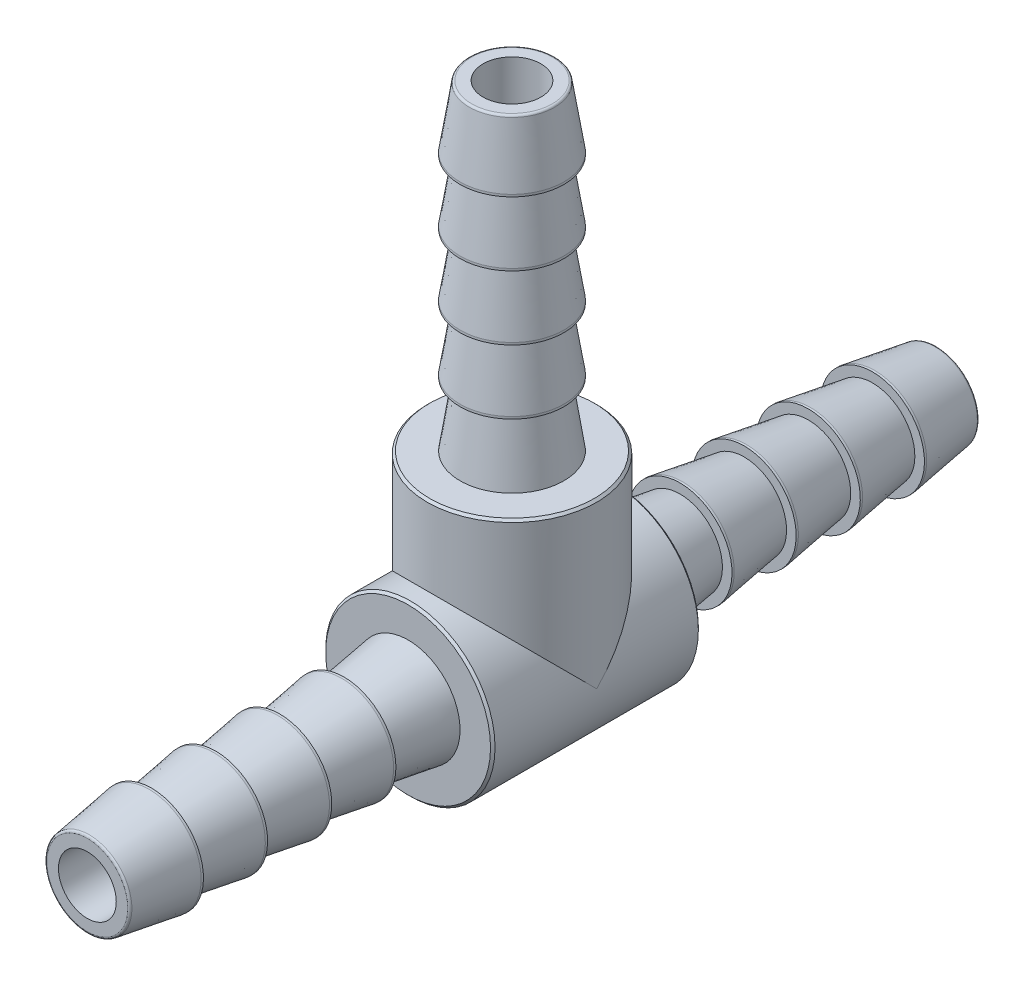
ISO-10303-21;
HEADER;
FILE_DESCRIPTION(('STEP AP214'),'2;1');
FILE_NAME('part.step','',(''),(''),'','','');
FILE_SCHEMA(('AUTOMOTIVE_DESIGN { 1 0 10303 214 1 1 1 1 }'));
ENDSEC;
DATA;
#1=APPLICATION_CONTEXT('core data for automotive mechanical design processes');
#2=APPLICATION_PROTOCOL_DEFINITION('international standard','automotive_design',2000,#1);
#3=PRODUCT_CONTEXT('',#1,'mechanical');
#4=PRODUCT('Part','Part','',(#3));
#5=PRODUCT_RELATED_PRODUCT_CATEGORY('part','',(#4));
#6=PRODUCT_DEFINITION_FORMATION('','',#4);
#7=PRODUCT_DEFINITION_CONTEXT('part definition',#1,'design');
#8=PRODUCT_DEFINITION('design','',#6,#7);
#9=PRODUCT_DEFINITION_SHAPE('','',#8);
#10=(LENGTH_UNIT() NAMED_UNIT(*) SI_UNIT(.MILLI.,.METRE.));
#11=(NAMED_UNIT(*) PLANE_ANGLE_UNIT() SI_UNIT($,.RADIAN.));
#12=(NAMED_UNIT(*) SI_UNIT($,.STERADIAN.) SOLID_ANGLE_UNIT());
#13=UNCERTAINTY_MEASURE_WITH_UNIT(LENGTH_MEASURE(1.E-05),#10,'distance_accuracy_value','');
#14=(GEOMETRIC_REPRESENTATION_CONTEXT(3) GLOBAL_UNCERTAINTY_ASSIGNED_CONTEXT((#13)) GLOBAL_UNIT_ASSIGNED_CONTEXT((#10,
#11,#12)) REPRESENTATION_CONTEXT('',''));
#15=CARTESIAN_POINT('',(0.,0.,0.));
#16=DIRECTION('',(0.,0.,1.));
#17=DIRECTION('',(1.,0.,0.));
#18=AXIS2_PLACEMENT_3D('',#15,#16,#17);
#19=CARTESIAN_POINT('',(0.,0.,23.876));
#20=DIRECTION('',(0.,0.,-1.));
#21=DIRECTION('',(-1.,0.,0.));
#22=AXIS2_PLACEMENT_3D('',#19,#20,#21);
#23=PLANE('',#22);
#24=CARTESIAN_POINT('',(0.,0.,23.876));
#25=DIRECTION('',(0.,0.,-1.));
#26=DIRECTION('',(-1.,0.,0.));
#27=AXIS2_PLACEMENT_3D('',#24,#25,#26);
#28=CIRCLE('',#27,2.27243024163016);
#29=CARTESIAN_POINT('',(-2.27243024163016,0.,23.876));
#30=VERTEX_POINT('',#29);
#31=EDGE_CURVE('E11',#30,#30,#28,.F.);
#32=ORIENTED_EDGE('',*,*,#31,.T.);
#33=EDGE_LOOP('',(#32));
#34=FACE_BOUND('',#33,.T.);
#35=CARTESIAN_POINT('',(0.,0.,23.876));
#36=DIRECTION('',(0.,0.,1.));
#37=DIRECTION('',(1.,0.,0.));
#38=AXIS2_PLACEMENT_3D('',#35,#36,#37);
#39=CIRCLE('',#38,1.6256);
#40=CARTESIAN_POINT('',(1.6256,0.,23.876));
#41=VERTEX_POINT('',#40);
#42=EDGE_CURVE('E75',#41,#41,#39,.T.);
#43=ORIENTED_EDGE('',*,*,#42,.F.);
#44=EDGE_LOOP('',(#43));
#45=FACE_BOUND('',#44,.T.);
#46=ADVANCED_FACE('F37',(#34,#45),#23,.F.);
#47=CARTESIAN_POINT('',(0.,0.,0.));
#48=DIRECTION('',(0.,-1.,0.));
#49=DIRECTION('',(0.,0.,-1.));
#50=AXIS2_PLACEMENT_3D('',#47,#48,#49);
#51=CYLINDRICAL_SURFACE('',#50,4.7625);
#52=CARTESIAN_POINT('',(0.,9.08049999999999,0.));
#53=DIRECTION('',(0.,1.,0.));
#54=DIRECTION('',(0.,0.,1.));
#55=AXIS2_PLACEMENT_3D('',#52,#53,#54);
#56=CIRCLE('',#55,4.7625);
#57=CARTESIAN_POINT('',(0.,9.08049999999999,4.7625));
#58=VERTEX_POINT('',#57);
#59=EDGE_CURVE('E69',#58,#58,#56,.F.);
#60=ORIENTED_EDGE('',*,*,#59,.T.);
#61=EDGE_LOOP('',(#60));
#62=FACE_BOUND('',#61,.T.);
#63=CARTESIAN_POINT('',(0.,0.,0.));
#64=DIRECTION('',(0.,0.707106781186547,0.707106781186547));
#65=DIRECTION('',(0.,-0.707106781186547,0.707106781186547));
#66=AXIS2_PLACEMENT_3D('',#63,#64,#65);
#67=ELLIPSE('',#66,6.73519209080187,4.7625);
#68=CARTESIAN_POINT('',(4.7625,0.,0.));
#69=VERTEX_POINT('',#68);
#70=CARTESIAN_POINT('',(-4.7625,0.,0.));
#71=VERTEX_POINT('',#70);
#72=EDGE_CURVE('E58',#69,#71,#67,.T.);
#73=ORIENTED_EDGE('',*,*,#72,.T.);
#74=CARTESIAN_POINT('',(0.,0.,0.));
#75=DIRECTION('',(0.,-0.707106781186547,0.707106781186547));
#76=DIRECTION('',(0.,0.707106781186547,0.707106781186547));
#77=AXIS2_PLACEMENT_3D('',#74,#75,#76);
#78=ELLIPSE('',#77,6.73519209080187,4.7625);
#79=EDGE_CURVE('E70',#71,#69,#78,.F.);
#80=ORIENTED_EDGE('',*,*,#79,.T.);
#81=EDGE_LOOP('',(#73,#80));
#82=FACE_BOUND('',#81,.T.);
#83=ADVANCED_FACE('F247',(#62,#82),#51,.T.);
#84=CARTESIAN_POINT('',(0.,0.,23.876));
#85=DIRECTION('',(0.,0.,1.));
#86=DIRECTION('',(1.,0.,0.));
#87=AXIS2_PLACEMENT_3D('',#84,#85,#86);
#88=CYLINDRICAL_SURFACE('',#87,4.7625);
#89=CARTESIAN_POINT('',(0.,0.,-5.715));
#90=DIRECTION('',(0.,0.,-1.));
#91=DIRECTION('',(-1.,0.,0.));
#92=AXIS2_PLACEMENT_3D('',#89,#90,#91);
#93=CIRCLE('',#92,4.7625);
#94=CARTESIAN_POINT('',(-4.7625,0.,-5.715));
#95=VERTEX_POINT('',#94);
#96=EDGE_CURVE('E211',#95,#95,#93,.F.);
#97=ORIENTED_EDGE('',*,*,#96,.T.);
#98=EDGE_LOOP('',(#97));
#99=FACE_BOUND('',#98,.T.);
#100=CARTESIAN_POINT('',(0.,0.,5.715));
#101=DIRECTION('',(0.,0.,1.));
#102=DIRECTION('',(1.,0.,0.));
#103=AXIS2_PLACEMENT_3D('',#100,#101,#102);
#104=CIRCLE('',#103,4.7625);
#105=CARTESIAN_POINT('',(4.7625,0.,5.715));
#106=VERTEX_POINT('',#105);
#107=EDGE_CURVE('E208',#106,#106,#104,.F.);
#108=ORIENTED_EDGE('',*,*,#107,.T.);
#109=EDGE_LOOP('',(#108));
#110=FACE_BOUND('',#109,.T.);
#111=ORIENTED_EDGE('',*,*,#79,.F.);
#112=ORIENTED_EDGE('',*,*,#72,.F.);
#113=EDGE_LOOP('',(#111,#112));
#114=FACE_BOUND('',#113,.T.);
#115=ADVANCED_FACE('F255',(#99,#110,#114),#88,.T.);
#116=CARTESIAN_POINT('',(0.,0.,16.7894));
#117=DIRECTION('',(0.,0.,-1.));
#118=DIRECTION('',(0.,1.,0.));
#119=AXIS2_PLACEMENT_3D('',#116,#117,#118);
#120=CONICAL_SURFACE('',#119,2.921,0.153883218638279);
#121=CARTESIAN_POINT('',(0.,0.,20.2692));
#122=DIRECTION('',(0.,0.,-1.));
#123=DIRECTION('',(0.,1.,0.));
#124=AXIS2_PLACEMENT_3D('',#121,#122,#123);
#125=CIRCLE('',#124,2.38125);
#126=CARTESIAN_POINT('',(0.,2.38125,20.2692));
#127=VERTEX_POINT('',#126);
#128=EDGE_CURVE('E180',#127,#127,#125,.T.);
#129=ORIENTED_EDGE('',*,*,#128,.T.);
#130=EDGE_LOOP('',(#129));
#131=FACE_BOUND('',#130,.T.);
#132=CARTESIAN_POINT('',(0.,0.,16.7894));
#133=DIRECTION('',(0.,0.,-1.));
#134=DIRECTION('',(0.,1.,0.));
#135=AXIS2_PLACEMENT_3D('',#132,#133,#134);
#136=CIRCLE('',#135,2.921);
#137=CARTESIAN_POINT('',(0.,2.921,16.7894));
#138=VERTEX_POINT('',#137);
#139=EDGE_CURVE('E186',#138,#138,#136,.T.);
#140=ORIENTED_EDGE('',*,*,#139,.F.);
#141=EDGE_LOOP('',(#140));
#142=FACE_BOUND('',#141,.T.);
#143=ADVANCED_FACE('F409',(#131,#142),#120,.T.);
#144=CARTESIAN_POINT('',(0.,0.,2.2352));
#145=DIRECTION('',(0.,0.,-1.));
#146=DIRECTION('',(0.,1.,0.));
#147=AXIS2_PLACEMENT_3D('',#144,#145,#146);
#148=CYLINDRICAL_SURFACE('',#147,2.921);
#149=ORIENTED_EDGE('',*,*,#139,.T.);
#150=EDGE_LOOP('',(#149));
#151=FACE_BOUND('',#150,.T.);
#152=CARTESIAN_POINT('',(0.,0.,16.6624));
#153=DIRECTION('',(0.,0.,-1.));
#154=DIRECTION('',(0.,1.,0.));
#155=AXIS2_PLACEMENT_3D('',#152,#153,#154);
#156=CIRCLE('',#155,2.921);
#157=CARTESIAN_POINT('',(0.,2.921,16.6624));
#158=VERTEX_POINT('',#157);
#159=EDGE_CURVE('E183',#158,#158,#156,.T.);
#160=ORIENTED_EDGE('',*,*,#159,.F.);
#161=EDGE_LOOP('',(#160));
#162=FACE_BOUND('',#161,.T.);
#163=ADVANCED_FACE('F405',(#151,#162),#148,.T.);
#164=CARTESIAN_POINT('',(0.,2.38125,16.6624));
#165=DIRECTION('',(0.,0.,-1.));
#166=DIRECTION('',(0.,1.,0.));
#167=AXIS2_PLACEMENT_3D('',#164,#165,#166);
#168=PLANE('',#167);
#169=ORIENTED_EDGE('',*,*,#159,.T.);
#170=EDGE_LOOP('',(#169));
#171=FACE_BOUND('',#170,.T.);
#172=CARTESIAN_POINT('',(0.,0.,16.6624));
#173=DIRECTION('',(0.,0.,-1.));
#174=DIRECTION('',(0.,1.,0.));
#175=AXIS2_PLACEMENT_3D('',#172,#173,#174);
#176=CIRCLE('',#175,2.38125);
#177=CARTESIAN_POINT('',(0.,2.38125,16.6624));
#178=VERTEX_POINT('',#177);
#179=EDGE_CURVE('E171',#178,#178,#176,.T.);
#180=ORIENTED_EDGE('',*,*,#179,.F.);
#181=EDGE_LOOP('',(#180));
#182=FACE_BOUND('',#181,.T.);
#183=ADVANCED_FACE('F402',(#171,#182),#168,.T.);
#184=CARTESIAN_POINT('',(0.,0.,20.3962));
#185=DIRECTION('',(0.,0.,-1.));
#186=DIRECTION('',(0.,1.,0.));
#187=AXIS2_PLACEMENT_3D('',#184,#185,#186);
#188=CONICAL_SURFACE('',#187,2.921,0.153883218638279);
#189=CARTESIAN_POINT('',(0.,0.,23.7684661295191));
#190=DIRECTION('',(0.,0.,-1.));
#191=DIRECTION('',(0.,1.,0.));
#192=AXIS2_PLACEMENT_3D('',#189,#190,#191);
#193=CIRCLE('',#192,2.39792952370598);
#194=CARTESIAN_POINT('',(0.,2.39792952370598,23.7684661295191));
#195=VERTEX_POINT('',#194);
#196=EDGE_CURVE('E45',#195,#195,#193,.T.);
#197=ORIENTED_EDGE('',*,*,#196,.T.);
#198=EDGE_LOOP('',(#197));
#199=FACE_BOUND('',#198,.T.);
#200=CARTESIAN_POINT('',(0.,0.,20.3962));
#201=DIRECTION('',(0.,0.,-1.));
#202=DIRECTION('',(0.,1.,0.));
#203=AXIS2_PLACEMENT_3D('',#200,#201,#202);
#204=CIRCLE('',#203,2.921);
#205=CARTESIAN_POINT('',(0.,2.921,20.3962));
#206=VERTEX_POINT('',#205);
#207=EDGE_CURVE('E192',#206,#206,#204,.T.);
#208=ORIENTED_EDGE('',*,*,#207,.F.);
#209=EDGE_LOOP('',(#208));
#210=FACE_BOUND('',#209,.T.);
#211=ADVANCED_FACE('F234',(#199,#210),#188,.T.);
#212=CARTESIAN_POINT('',(0.,0.,5.842));
#213=DIRECTION('',(0.,0.,-1.));
#214=DIRECTION('',(0.,1.,0.));
#215=AXIS2_PLACEMENT_3D('',#212,#213,#214);
#216=CYLINDRICAL_SURFACE('',#215,2.921);
#217=ORIENTED_EDGE('',*,*,#207,.T.);
#218=EDGE_LOOP('',(#217));
#219=FACE_BOUND('',#218,.T.);
#220=CARTESIAN_POINT('',(0.,0.,20.2692));
#221=DIRECTION('',(0.,0.,-1.));
#222=DIRECTION('',(0.,1.,0.));
#223=AXIS2_PLACEMENT_3D('',#220,#221,#222);
#224=CIRCLE('',#223,2.921);
#225=CARTESIAN_POINT('',(0.,2.921,20.2692));
#226=VERTEX_POINT('',#225);
#227=EDGE_CURVE('E189',#226,#226,#224,.T.);
#228=ORIENTED_EDGE('',*,*,#227,.F.);
#229=EDGE_LOOP('',(#228));
#230=FACE_BOUND('',#229,.T.);
#231=ADVANCED_FACE('F416',(#219,#230),#216,.T.);
#232=CARTESIAN_POINT('',(0.,2.38125,20.2692));
#233=DIRECTION('',(0.,0.,-1.));
#234=DIRECTION('',(0.,1.,0.));
#235=AXIS2_PLACEMENT_3D('',#232,#233,#234);
#236=PLANE('',#235);
#237=ORIENTED_EDGE('',*,*,#227,.T.);
#238=EDGE_LOOP('',(#237));
#239=FACE_BOUND('',#238,.T.);
#240=ORIENTED_EDGE('',*,*,#128,.F.);
#241=EDGE_LOOP('',(#240));
#242=FACE_BOUND('',#241,.T.);
#243=ADVANCED_FACE('F400',(#239,#242),#236,.T.);
#244=CARTESIAN_POINT('',(0.,0.,13.1826));
#245=DIRECTION('',(0.,0.,-1.));
#246=DIRECTION('',(0.,1.,0.));
#247=AXIS2_PLACEMENT_3D('',#244,#245,#246);
#248=CONICAL_SURFACE('',#247,2.921,0.153883218638279);
#249=ORIENTED_EDGE('',*,*,#179,.T.);
#250=EDGE_LOOP('',(#249));
#251=FACE_BOUND('',#250,.T.);
#252=CARTESIAN_POINT('',(0.,0.,13.1826));
#253=DIRECTION('',(0.,0.,-1.));
#254=DIRECTION('',(0.,1.,0.));
#255=AXIS2_PLACEMENT_3D('',#252,#253,#254);
#256=CIRCLE('',#255,2.921);
#257=CARTESIAN_POINT('',(0.,2.921,13.1826));
#258=VERTEX_POINT('',#257);
#259=EDGE_CURVE('E177',#258,#258,#256,.T.);
#260=ORIENTED_EDGE('',*,*,#259,.F.);
#261=EDGE_LOOP('',(#260));
#262=FACE_BOUND('',#261,.T.);
#263=ADVANCED_FACE('F396',(#251,#262),#248,.T.);
#264=CARTESIAN_POINT('',(0.,0.,-1.3716));
#265=DIRECTION('',(0.,0.,-1.));
#266=DIRECTION('',(0.,1.,0.));
#267=AXIS2_PLACEMENT_3D('',#264,#265,#266);
#268=CYLINDRICAL_SURFACE('',#267,2.921);
#269=ORIENTED_EDGE('',*,*,#259,.T.);
#270=EDGE_LOOP('',(#269));
#271=FACE_BOUND('',#270,.T.);
#272=CARTESIAN_POINT('',(0.,0.,13.0556));
#273=DIRECTION('',(0.,0.,-1.));
#274=DIRECTION('',(0.,1.,0.));
#275=AXIS2_PLACEMENT_3D('',#272,#273,#274);
#276=CIRCLE('',#275,2.921);
#277=CARTESIAN_POINT('',(0.,2.921,13.0556));
#278=VERTEX_POINT('',#277);
#279=EDGE_CURVE('E174',#278,#278,#276,.T.);
#280=ORIENTED_EDGE('',*,*,#279,.F.);
#281=EDGE_LOOP('',(#280));
#282=FACE_BOUND('',#281,.T.);
#283=ADVANCED_FACE('F392',(#271,#282),#268,.T.);
#284=CARTESIAN_POINT('',(0.,2.38125,13.0556));
#285=DIRECTION('',(0.,0.,-1.));
#286=DIRECTION('',(0.,1.,0.));
#287=AXIS2_PLACEMENT_3D('',#284,#285,#286);
#288=PLANE('',#287);
#289=ORIENTED_EDGE('',*,*,#279,.T.);
#290=EDGE_LOOP('',(#289));
#291=FACE_BOUND('',#290,.T.);
#292=CARTESIAN_POINT('',(0.,0.,13.0556));
#293=DIRECTION('',(0.,0.,-1.));
#294=DIRECTION('',(0.,1.,0.));
#295=AXIS2_PLACEMENT_3D('',#292,#293,#294);
#296=CIRCLE('',#295,2.38125);
#297=CARTESIAN_POINT('',(0.,2.38125,13.0556));
#298=VERTEX_POINT('',#297);
#299=EDGE_CURVE('E162',#298,#298,#296,.T.);
#300=ORIENTED_EDGE('',*,*,#299,.F.);
#301=EDGE_LOOP('',(#300));
#302=FACE_BOUND('',#301,.T.);
#303=ADVANCED_FACE('F388',(#291,#302),#288,.T.);
#304=CARTESIAN_POINT('',(0.,0.,9.5758));
#305=DIRECTION('',(0.,0.,-1.));
#306=DIRECTION('',(0.,1.,0.));
#307=AXIS2_PLACEMENT_3D('',#304,#305,#306);
#308=CONICAL_SURFACE('',#307,2.921,0.153883218638279);
#309=ORIENTED_EDGE('',*,*,#299,.T.);
#310=EDGE_LOOP('',(#309));
#311=FACE_BOUND('',#310,.T.);
#312=CARTESIAN_POINT('',(0.,0.,9.5758));
#313=DIRECTION('',(0.,0.,-1.));
#314=DIRECTION('',(0.,1.,0.));
#315=AXIS2_PLACEMENT_3D('',#312,#313,#314);
#316=CIRCLE('',#315,2.921);
#317=CARTESIAN_POINT('',(0.,2.921,9.5758));
#318=VERTEX_POINT('',#317);
#319=EDGE_CURVE('E168',#318,#318,#316,.T.);
#320=ORIENTED_EDGE('',*,*,#319,.F.);
#321=EDGE_LOOP('',(#320));
#322=FACE_BOUND('',#321,.T.);
#323=ADVANCED_FACE('F384',(#311,#322),#308,.T.);
#324=CARTESIAN_POINT('',(0.,0.,-4.9784));
#325=DIRECTION('',(0.,0.,-1.));
#326=DIRECTION('',(0.,1.,0.));
#327=AXIS2_PLACEMENT_3D('',#324,#325,#326);
#328=CYLINDRICAL_SURFACE('',#327,2.921);
#329=ORIENTED_EDGE('',*,*,#319,.T.);
#330=EDGE_LOOP('',(#329));
#331=FACE_BOUND('',#330,.T.);
#332=CARTESIAN_POINT('',(0.,0.,9.4488));
#333=DIRECTION('',(0.,0.,-1.));
#334=DIRECTION('',(0.,1.,0.));
#335=AXIS2_PLACEMENT_3D('',#332,#333,#334);
#336=CIRCLE('',#335,2.921);
#337=CARTESIAN_POINT('',(0.,2.921,9.4488));
#338=VERTEX_POINT('',#337);
#339=EDGE_CURVE('E165',#338,#338,#336,.T.);
#340=ORIENTED_EDGE('',*,*,#339,.F.);
#341=EDGE_LOOP('',(#340));
#342=FACE_BOUND('',#341,.T.);
#343=ADVANCED_FACE('F380',(#331,#342),#328,.T.);
#344=CARTESIAN_POINT('',(0.,2.38125,9.4488));
#345=DIRECTION('',(0.,0.,-1.));
#346=DIRECTION('',(0.,1.,0.));
#347=AXIS2_PLACEMENT_3D('',#344,#345,#346);
#348=PLANE('',#347);
#349=ORIENTED_EDGE('',*,*,#339,.T.);
#350=EDGE_LOOP('',(#349));
#351=FACE_BOUND('',#350,.T.);
#352=CARTESIAN_POINT('',(0.,0.,9.4488));
#353=DIRECTION('',(0.,0.,1.));
#354=DIRECTION('',(1.,0.,0.));
#355=AXIS2_PLACEMENT_3D('',#352,#353,#354);
#356=CIRCLE('',#355,2.38125);
#357=CARTESIAN_POINT('',(2.38125,0.,9.4488));
#358=VERTEX_POINT('',#357);
#359=EDGE_CURVE('E198',#358,#358,#356,.T.);
#360=ORIENTED_EDGE('',*,*,#359,.T.);
#361=EDGE_LOOP('',(#360));
#362=FACE_BOUND('',#361,.T.);
#363=ADVANCED_FACE('F376',(#351,#362),#348,.T.);
#364=CARTESIAN_POINT('',(0.,2.921,5.842));
#365=DIRECTION('',(0.,0.,1.));
#366=DIRECTION('',(1.,0.,0.));
#367=AXIS2_PLACEMENT_3D('',#364,#365,#366);
#368=PLANE('',#367);
#369=CARTESIAN_POINT('',(0.,0.,5.842));
#370=DIRECTION('',(0.,0.,1.));
#371=DIRECTION('',(1.,0.,0.));
#372=AXIS2_PLACEMENT_3D('',#369,#370,#371);
#373=CIRCLE('',#372,4.6355);
#374=CARTESIAN_POINT('',(4.6355,0.,5.842));
#375=VERTEX_POINT('',#374);
#376=EDGE_CURVE('E217',#375,#375,#373,.T.);
#377=ORIENTED_EDGE('',*,*,#376,.T.);
#378=EDGE_LOOP('',(#377));
#379=FACE_BOUND('',#378,.T.);
#380=CARTESIAN_POINT('',(0.,0.,5.842));
#381=DIRECTION('',(0.,0.,1.));
#382=DIRECTION('',(1.,0.,0.));
#383=AXIS2_PLACEMENT_3D('',#380,#381,#382);
#384=CIRCLE('',#383,2.921);
#385=CARTESIAN_POINT('',(2.921,0.,5.842));
#386=VERTEX_POINT('',#385);
#387=EDGE_CURVE('E195',#386,#386,#384,.T.);
#388=ORIENTED_EDGE('',*,*,#387,.F.);
#389=EDGE_LOOP('',(#388));
#390=FACE_BOUND('',#389,.T.);
#391=ADVANCED_FACE('F379',(#379,#390),#368,.T.);
#392=CARTESIAN_POINT('',(0.,0.,9.4488));
#393=DIRECTION('',(0.,0.,-1.));
#394=DIRECTION('',(-1.,0.,0.));
#395=AXIS2_PLACEMENT_3D('',#392,#393,#394);
#396=CONICAL_SURFACE('',#395,2.38125,0.148545565358798);
#397=ORIENTED_EDGE('',*,*,#387,.T.);
#398=EDGE_LOOP('',(#397));
#399=FACE_BOUND('',#398,.T.);
#400=ORIENTED_EDGE('',*,*,#359,.F.);
#401=EDGE_LOOP('',(#400));
#402=FACE_BOUND('',#401,.T.);
#403=ADVANCED_FACE('F374',(#399,#402),#396,.T.);
#404=CARTESIAN_POINT('',(0.,0.,-9.4488));
#405=DIRECTION('',(0.,0.,1.));
#406=DIRECTION('',(-1.,0.,0.));
#407=AXIS2_PLACEMENT_3D('',#404,#405,#406);
#408=CONICAL_SURFACE('',#407,2.38125,0.148545565358798);
#409=CARTESIAN_POINT('',(0.,0.,-5.842));
#410=DIRECTION('',(0.,0.,1.));
#411=DIRECTION('',(1.,0.,0.));
#412=AXIS2_PLACEMENT_3D('',#409,#410,#411);
#413=CIRCLE('',#412,2.921);
#414=CARTESIAN_POINT('',(2.921,0.,-5.842));
#415=VERTEX_POINT('',#414);
#416=EDGE_CURVE('E159',#415,#415,#413,.T.);
#417=ORIENTED_EDGE('',*,*,#416,.F.);
#418=EDGE_LOOP('',(#417));
#419=FACE_BOUND('',#418,.T.);
#420=CARTESIAN_POINT('',(0.,0.,-9.4488));
#421=DIRECTION('',(0.,0.,-1.));
#422=DIRECTION('',(0.,1.,0.));
#423=AXIS2_PLACEMENT_3D('',#420,#421,#422);
#424=CIRCLE('',#423,2.38125);
#425=CARTESIAN_POINT('',(0.,2.38125,-9.4488));
#426=VERTEX_POINT('',#425);
#427=EDGE_CURVE('E126',#426,#426,#424,.T.);
#428=ORIENTED_EDGE('',*,*,#427,.F.);
#429=EDGE_LOOP('',(#428));
#430=FACE_BOUND('',#429,.T.);
#431=ADVANCED_FACE('F370',(#419,#430),#408,.T.);
#432=CARTESIAN_POINT('',(0.,2.921,-5.842));
#433=DIRECTION('',(0.,0.,-1.));
#434=DIRECTION('',(1.,0.,0.));
#435=AXIS2_PLACEMENT_3D('',#432,#433,#434);
#436=PLANE('',#435);
#437=CARTESIAN_POINT('',(0.,0.,-5.842));
#438=DIRECTION('',(0.,0.,-1.));
#439=DIRECTION('',(-1.,0.,0.));
#440=AXIS2_PLACEMENT_3D('',#437,#438,#439);
#441=CIRCLE('',#440,4.63550000000001);
#442=CARTESIAN_POINT('',(-4.63550000000001,0.,-5.842));
#443=VERTEX_POINT('',#442);
#444=EDGE_CURVE('E214',#443,#443,#441,.T.);
#445=ORIENTED_EDGE('',*,*,#444,.T.);
#446=EDGE_LOOP('',(#445));
#447=FACE_BOUND('',#446,.T.);
#448=ORIENTED_EDGE('',*,*,#416,.T.);
#449=EDGE_LOOP('',(#448));
#450=FACE_BOUND('',#449,.T.);
#451=ADVANCED_FACE('F332',(#447,#450),#436,.T.);
#452=CARTESIAN_POINT('',(0.,0.,-9.5758));
#453=DIRECTION('',(0.,0.,1.));
#454=DIRECTION('',(0.,1.,0.));
#455=AXIS2_PLACEMENT_3D('',#452,#453,#454);
#456=CONICAL_SURFACE('',#455,2.921,0.153883218638279);
#457=CARTESIAN_POINT('',(0.,0.,-13.0556));
#458=DIRECTION('',(0.,0.,-1.));
#459=DIRECTION('',(0.,1.,0.));
#460=AXIS2_PLACEMENT_3D('',#457,#458,#459);
#461=CIRCLE('',#460,2.38125);
#462=CARTESIAN_POINT('',(0.,2.38125,-13.0556));
#463=VERTEX_POINT('',#462);
#464=EDGE_CURVE('E123',#463,#463,#461,.T.);
#465=ORIENTED_EDGE('',*,*,#464,.F.);
#466=EDGE_LOOP('',(#465));
#467=FACE_BOUND('',#466,.T.);
#468=CARTESIAN_POINT('',(0.,0.,-9.5758));
#469=DIRECTION('',(0.,0.,-1.));
#470=DIRECTION('',(0.,1.,0.));
#471=AXIS2_PLACEMENT_3D('',#468,#469,#470);
#472=CIRCLE('',#471,2.921);
#473=CARTESIAN_POINT('',(0.,2.921,-9.5758));
#474=VERTEX_POINT('',#473);
#475=EDGE_CURVE('E132',#474,#474,#472,.T.);
#476=ORIENTED_EDGE('',*,*,#475,.T.);
#477=EDGE_LOOP('',(#476));
#478=FACE_BOUND('',#477,.T.);
#479=ADVANCED_FACE('F328',(#467,#478),#456,.T.);
#480=CARTESIAN_POINT('',(0.,0.,4.9784));
#481=DIRECTION('',(0.,0.,1.));
#482=DIRECTION('',(0.,1.,0.));
#483=AXIS2_PLACEMENT_3D('',#480,#481,#482);
#484=CYLINDRICAL_SURFACE('',#483,2.921);
#485=ORIENTED_EDGE('',*,*,#475,.F.);
#486=EDGE_LOOP('',(#485));
#487=FACE_BOUND('',#486,.T.);
#488=CARTESIAN_POINT('',(0.,0.,-9.4488));
#489=DIRECTION('',(0.,0.,-1.));
#490=DIRECTION('',(0.,1.,0.));
#491=AXIS2_PLACEMENT_3D('',#488,#489,#490);
#492=CIRCLE('',#491,2.921);
#493=CARTESIAN_POINT('',(0.,2.921,-9.4488));
#494=VERTEX_POINT('',#493);
#495=EDGE_CURVE('E129',#494,#494,#492,.T.);
#496=ORIENTED_EDGE('',*,*,#495,.T.);
#497=EDGE_LOOP('',(#496));
#498=FACE_BOUND('',#497,.T.);
#499=ADVANCED_FACE('F324',(#487,#498),#484,.T.);
#500=CARTESIAN_POINT('',(0.,2.38125,-9.4488));
#501=DIRECTION('',(0.,0.,1.));
#502=DIRECTION('',(0.,1.,0.));
#503=AXIS2_PLACEMENT_3D('',#500,#501,#502);
#504=PLANE('',#503);
#505=ORIENTED_EDGE('',*,*,#495,.F.);
#506=EDGE_LOOP('',(#505));
#507=FACE_BOUND('',#506,.T.);
#508=ORIENTED_EDGE('',*,*,#427,.T.);
#509=EDGE_LOOP('',(#508));
#510=FACE_BOUND('',#509,.T.);
#511=ADVANCED_FACE('F266',(#507,#510),#504,.T.);
#512=CARTESIAN_POINT('',(0.,0.,-23.876));
#513=DIRECTION('',(0.,0.,1.));
#514=DIRECTION('',(1.,0.,0.));
#515=AXIS2_PLACEMENT_3D('',#512,#513,#514);
#516=PLANE('',#515);
#517=CARTESIAN_POINT('',(0.,0.,-23.876));
#518=DIRECTION('',(0.,0.,1.));
#519=DIRECTION('',(1.,0.,0.));
#520=AXIS2_PLACEMENT_3D('',#517,#518,#519);
#521=CIRCLE('',#520,2.27243024163016);
#522=CARTESIAN_POINT('',(2.27243024163016,0.,-23.876));
#523=VERTEX_POINT('',#522);
#524=EDGE_CURVE('E229',#523,#523,#521,.F.);
#525=ORIENTED_EDGE('',*,*,#524,.T.);
#526=EDGE_LOOP('',(#525));
#527=FACE_BOUND('',#526,.T.);
#528=ADVANCED_FACE('F262',(#527),#516,.F.);
#529=CARTESIAN_POINT('',(0.,0.,-20.3962));
#530=DIRECTION('',(0.,0.,1.));
#531=DIRECTION('',(0.,1.,0.));
#532=AXIS2_PLACEMENT_3D('',#529,#530,#531);
#533=CONICAL_SURFACE('',#532,2.921,0.153883218638279);
#534=CARTESIAN_POINT('',(0.,0.,-23.7684661295191));
#535=DIRECTION('',(0.,0.,1.));
#536=DIRECTION('',(0.,-1.,0.));
#537=AXIS2_PLACEMENT_3D('',#534,#535,#536);
#538=CIRCLE('',#537,2.39792952370598);
#539=CARTESIAN_POINT('',(0.,-2.39792952370598,-23.7684661295191));
#540=VERTEX_POINT('',#539);
#541=EDGE_CURVE('E226',#540,#540,#538,.T.);
#542=ORIENTED_EDGE('',*,*,#541,.T.);
#543=EDGE_LOOP('',(#542));
#544=FACE_BOUND('',#543,.T.);
#545=CARTESIAN_POINT('',(0.,0.,-20.3962));
#546=DIRECTION('',(0.,0.,-1.));
#547=DIRECTION('',(0.,1.,0.));
#548=AXIS2_PLACEMENT_3D('',#545,#546,#547);
#549=CIRCLE('',#548,2.921);
#550=CARTESIAN_POINT('',(0.,2.921,-20.3962));
#551=VERTEX_POINT('',#550);
#552=EDGE_CURVE('E156',#551,#551,#549,.T.);
#553=ORIENTED_EDGE('',*,*,#552,.T.);
#554=EDGE_LOOP('',(#553));
#555=FACE_BOUND('',#554,.T.);
#556=ADVANCED_FACE('F265',(#544,#555),#533,.T.);
#557=CARTESIAN_POINT('',(0.,0.,-5.842));
#558=DIRECTION('',(0.,0.,1.));
#559=DIRECTION('',(0.,1.,0.));
#560=AXIS2_PLACEMENT_3D('',#557,#558,#559);
#561=CYLINDRICAL_SURFACE('',#560,2.921);
#562=ORIENTED_EDGE('',*,*,#552,.F.);
#563=EDGE_LOOP('',(#562));
#564=FACE_BOUND('',#563,.T.);
#565=CARTESIAN_POINT('',(0.,0.,-20.2692));
#566=DIRECTION('',(0.,0.,-1.));
#567=DIRECTION('',(0.,1.,0.));
#568=AXIS2_PLACEMENT_3D('',#565,#566,#567);
#569=CIRCLE('',#568,2.921);
#570=CARTESIAN_POINT('',(0.,2.921,-20.2692));
#571=VERTEX_POINT('',#570);
#572=EDGE_CURVE('E153',#571,#571,#569,.T.);
#573=ORIENTED_EDGE('',*,*,#572,.T.);
#574=EDGE_LOOP('',(#573));
#575=FACE_BOUND('',#574,.T.);
#576=ADVANCED_FACE('F360',(#564,#575),#561,.T.);
#577=CARTESIAN_POINT('',(0.,2.38125,-20.2692));
#578=DIRECTION('',(0.,0.,1.));
#579=DIRECTION('',(0.,1.,0.));
#580=AXIS2_PLACEMENT_3D('',#577,#578,#579);
#581=PLANE('',#580);
#582=ORIENTED_EDGE('',*,*,#572,.F.);
#583=EDGE_LOOP('',(#582));
#584=FACE_BOUND('',#583,.T.);
#585=CARTESIAN_POINT('',(0.,0.,-20.2692));
#586=DIRECTION('',(0.,0.,-1.));
#587=DIRECTION('',(0.,1.,0.));
#588=AXIS2_PLACEMENT_3D('',#585,#586,#587);
#589=CIRCLE('',#588,2.38125);
#590=CARTESIAN_POINT('',(0.,2.38125,-20.2692));
#591=VERTEX_POINT('',#590);
#592=EDGE_CURVE('E144',#591,#591,#589,.T.);
#593=ORIENTED_EDGE('',*,*,#592,.T.);
#594=EDGE_LOOP('',(#593));
#595=FACE_BOUND('',#594,.T.);
#596=ADVANCED_FACE('F356',(#584,#595),#581,.T.);
#597=CARTESIAN_POINT('',(0.,0.,-16.7894));
#598=DIRECTION('',(0.,0.,1.));
#599=DIRECTION('',(0.,1.,0.));
#600=AXIS2_PLACEMENT_3D('',#597,#598,#599);
#601=CONICAL_SURFACE('',#600,2.921,0.153883218638279);
#602=ORIENTED_EDGE('',*,*,#592,.F.);
#603=EDGE_LOOP('',(#602));
#604=FACE_BOUND('',#603,.T.);
#605=CARTESIAN_POINT('',(0.,0.,-16.7894));
#606=DIRECTION('',(0.,0.,-1.));
#607=DIRECTION('',(0.,1.,0.));
#608=AXIS2_PLACEMENT_3D('',#605,#606,#607);
#609=CIRCLE('',#608,2.921);
#610=CARTESIAN_POINT('',(0.,2.921,-16.7894));
#611=VERTEX_POINT('',#610);
#612=EDGE_CURVE('E150',#611,#611,#609,.T.);
#613=ORIENTED_EDGE('',*,*,#612,.T.);
#614=EDGE_LOOP('',(#613));
#615=FACE_BOUND('',#614,.T.);
#616=ADVANCED_FACE('F352',(#604,#615),#601,.T.);
#617=CARTESIAN_POINT('',(0.,0.,-2.2352));
#618=DIRECTION('',(0.,0.,1.));
#619=DIRECTION('',(0.,1.,0.));
#620=AXIS2_PLACEMENT_3D('',#617,#618,#619);
#621=CYLINDRICAL_SURFACE('',#620,2.921);
#622=ORIENTED_EDGE('',*,*,#612,.F.);
#623=EDGE_LOOP('',(#622));
#624=FACE_BOUND('',#623,.T.);
#625=CARTESIAN_POINT('',(0.,0.,-16.6624));
#626=DIRECTION('',(0.,0.,-1.));
#627=DIRECTION('',(0.,1.,0.));
#628=AXIS2_PLACEMENT_3D('',#625,#626,#627);
#629=CIRCLE('',#628,2.921);
#630=CARTESIAN_POINT('',(0.,2.921,-16.6624));
#631=VERTEX_POINT('',#630);
#632=EDGE_CURVE('E147',#631,#631,#629,.T.);
#633=ORIENTED_EDGE('',*,*,#632,.T.);
#634=EDGE_LOOP('',(#633));
#635=FACE_BOUND('',#634,.T.);
#636=ADVANCED_FACE('F348',(#624,#635),#621,.T.);
#637=CARTESIAN_POINT('',(0.,2.38125,-16.6624));
#638=DIRECTION('',(0.,0.,1.));
#639=DIRECTION('',(0.,1.,0.));
#640=AXIS2_PLACEMENT_3D('',#637,#638,#639);
#641=PLANE('',#640);
#642=ORIENTED_EDGE('',*,*,#632,.F.);
#643=EDGE_LOOP('',(#642));
#644=FACE_BOUND('',#643,.T.);
#645=CARTESIAN_POINT('',(0.,0.,-16.6624));
#646=DIRECTION('',(0.,0.,-1.));
#647=DIRECTION('',(0.,1.,0.));
#648=AXIS2_PLACEMENT_3D('',#645,#646,#647);
#649=CIRCLE('',#648,2.38125);
#650=CARTESIAN_POINT('',(0.,2.38125,-16.6624));
#651=VERTEX_POINT('',#650);
#652=EDGE_CURVE('E135',#651,#651,#649,.T.);
#653=ORIENTED_EDGE('',*,*,#652,.T.);
#654=EDGE_LOOP('',(#653));
#655=FACE_BOUND('',#654,.T.);
#656=ADVANCED_FACE('F344',(#644,#655),#641,.T.);
#657=CARTESIAN_POINT('',(0.,0.,-13.1826));
#658=DIRECTION('',(0.,0.,1.));
#659=DIRECTION('',(0.,1.,0.));
#660=AXIS2_PLACEMENT_3D('',#657,#658,#659);
#661=CONICAL_SURFACE('',#660,2.921,0.153883218638279);
#662=ORIENTED_EDGE('',*,*,#652,.F.);
#663=EDGE_LOOP('',(#662));
#664=FACE_BOUND('',#663,.T.);
#665=CARTESIAN_POINT('',(0.,0.,-13.1826));
#666=DIRECTION('',(0.,0.,-1.));
#667=DIRECTION('',(0.,1.,0.));
#668=AXIS2_PLACEMENT_3D('',#665,#666,#667);
#669=CIRCLE('',#668,2.921);
#670=CARTESIAN_POINT('',(0.,2.921,-13.1826));
#671=VERTEX_POINT('',#670);
#672=EDGE_CURVE('E141',#671,#671,#669,.T.);
#673=ORIENTED_EDGE('',*,*,#672,.T.);
#674=EDGE_LOOP('',(#673));
#675=FACE_BOUND('',#674,.T.);
#676=ADVANCED_FACE('F340',(#664,#675),#661,.T.);
#677=CARTESIAN_POINT('',(0.,0.,1.3716));
#678=DIRECTION('',(0.,0.,1.));
#679=DIRECTION('',(0.,1.,0.));
#680=AXIS2_PLACEMENT_3D('',#677,#678,#679);
#681=CYLINDRICAL_SURFACE('',#680,2.921);
#682=ORIENTED_EDGE('',*,*,#672,.F.);
#683=EDGE_LOOP('',(#682));
#684=FACE_BOUND('',#683,.T.);
#685=CARTESIAN_POINT('',(0.,0.,-13.0556));
#686=DIRECTION('',(0.,0.,-1.));
#687=DIRECTION('',(0.,1.,0.));
#688=AXIS2_PLACEMENT_3D('',#685,#686,#687);
#689=CIRCLE('',#688,2.921);
#690=CARTESIAN_POINT('',(0.,2.921,-13.0556));
#691=VERTEX_POINT('',#690);
#692=EDGE_CURVE('E138',#691,#691,#689,.T.);
#693=ORIENTED_EDGE('',*,*,#692,.T.);
#694=EDGE_LOOP('',(#693));
#695=FACE_BOUND('',#694,.T.);
#696=ADVANCED_FACE('F336',(#684,#695),#681,.T.);
#697=CARTESIAN_POINT('',(0.,2.38125,-13.0556));
#698=DIRECTION('',(0.,0.,1.));
#699=DIRECTION('',(0.,1.,0.));
#700=AXIS2_PLACEMENT_3D('',#697,#698,#699);
#701=PLANE('',#700);
#702=ORIENTED_EDGE('',*,*,#692,.F.);
#703=EDGE_LOOP('',(#702));
#704=FACE_BOUND('',#703,.T.);
#705=ORIENTED_EDGE('',*,*,#464,.T.);
#706=EDGE_LOOP('',(#705));
#707=FACE_BOUND('',#706,.T.);
#708=ADVANCED_FACE('F315',(#704,#707),#701,.T.);
#709=CARTESIAN_POINT('',(0.,9.2075,0.));
#710=DIRECTION('',(0.,-1.,0.));
#711=DIRECTION('',(0.,0.,-1.));
#712=AXIS2_PLACEMENT_3D('',#709,#710,#711);
#713=CONICAL_SURFACE('',#712,2.921,0.148545565358799);
#714=CARTESIAN_POINT('',(0.,12.8143,0.));
#715=DIRECTION('',(0.,1.,0.));
#716=DIRECTION('',(0.,0.,1.));
#717=AXIS2_PLACEMENT_3D('',#714,#715,#716);
#718=CIRCLE('',#717,2.38125);
#719=CARTESIAN_POINT('',(0.,12.8143,2.38125));
#720=VERTEX_POINT('',#719);
#721=EDGE_CURVE('E93',#720,#720,#718,.T.);
#722=ORIENTED_EDGE('',*,*,#721,.F.);
#723=EDGE_LOOP('',(#722));
#724=FACE_BOUND('',#723,.T.);
#725=CARTESIAN_POINT('',(0.,9.2075,0.));
#726=DIRECTION('',(0.,-1.,0.));
#727=DIRECTION('',(0.,0.,-1.));
#728=AXIS2_PLACEMENT_3D('',#725,#726,#727);
#729=CIRCLE('',#728,2.921);
#730=CARTESIAN_POINT('',(0.,9.2075,-2.921));
#731=VERTEX_POINT('',#730);
#732=EDGE_CURVE('E120',#731,#731,#729,.T.);
#733=ORIENTED_EDGE('',*,*,#732,.F.);
#734=EDGE_LOOP('',(#733));
#735=FACE_BOUND('',#734,.T.);
#736=ADVANCED_FACE('F312',(#724,#735),#713,.T.);
#737=CARTESIAN_POINT('',(0.,9.2075,2.921));
#738=DIRECTION('',(0.,1.,0.));
#739=DIRECTION('',(0.,0.,1.));
#740=AXIS2_PLACEMENT_3D('',#737,#738,#739);
#741=PLANE('',#740);
#742=CARTESIAN_POINT('',(0.,9.2075,0.));
#743=DIRECTION('',(0.,1.,0.));
#744=DIRECTION('',(0.,0.,1.));
#745=AXIS2_PLACEMENT_3D('',#742,#743,#744);
#746=CIRCLE('',#745,4.63549999999999);
#747=CARTESIAN_POINT('',(0.,9.2075,4.63549999999999));
#748=VERTEX_POINT('',#747);
#749=EDGE_CURVE('E205',#748,#748,#746,.T.);
#750=ORIENTED_EDGE('',*,*,#749,.T.);
#751=EDGE_LOOP('',(#750));
#752=FACE_BOUND('',#751,.T.);
#753=ORIENTED_EDGE('',*,*,#732,.T.);
#754=EDGE_LOOP('',(#753));
#755=FACE_BOUND('',#754,.T.);
#756=ADVANCED_FACE('F308',(#752,#755),#741,.T.);
#757=CARTESIAN_POINT('',(0.,12.8143,2.921));
#758=DIRECTION('',(0.,-1.,0.));
#759=DIRECTION('',(0.,0.,-1.));
#760=AXIS2_PLACEMENT_3D('',#757,#758,#759);
#761=PLANE('',#760);
#762=ORIENTED_EDGE('',*,*,#721,.T.);
#763=EDGE_LOOP('',(#762));
#764=FACE_BOUND('',#763,.T.);
#765=CARTESIAN_POINT('',(0.,12.8143,0.));
#766=DIRECTION('',(0.,1.,0.));
#767=DIRECTION('',(0.,0.,1.));
#768=AXIS2_PLACEMENT_3D('',#765,#766,#767);
#769=CIRCLE('',#768,2.921);
#770=CARTESIAN_POINT('',(0.,12.8143,2.921));
#771=VERTEX_POINT('',#770);
#772=EDGE_CURVE('E90',#771,#771,#769,.T.);
#773=ORIENTED_EDGE('',*,*,#772,.F.);
#774=EDGE_LOOP('',(#773));
#775=FACE_BOUND('',#774,.T.);
#776=ADVANCED_FACE('F311',(#764,#775),#761,.T.);
#777=CARTESIAN_POINT('',(0.,16.4211,0.));
#778=DIRECTION('',(0.,1.,0.));
#779=DIRECTION('',(0.,0.,1.));
#780=AXIS2_PLACEMENT_3D('',#777,#778,#779);
#781=CYLINDRICAL_SURFACE('',#780,2.921);
#782=ORIENTED_EDGE('',*,*,#772,.T.);
#783=EDGE_LOOP('',(#782));
#784=FACE_BOUND('',#783,.T.);
#785=CARTESIAN_POINT('',(0.,12.9413,0.));
#786=DIRECTION('',(0.,1.,0.));
#787=DIRECTION('',(0.,0.,1.));
#788=AXIS2_PLACEMENT_3D('',#785,#786,#787);
#789=CIRCLE('',#788,2.921);
#790=CARTESIAN_POINT('',(0.,12.9413,2.921));
#791=VERTEX_POINT('',#790);
#792=EDGE_CURVE('E83',#791,#791,#789,.T.);
#793=ORIENTED_EDGE('',*,*,#792,.F.);
#794=EDGE_LOOP('',(#793));
#795=FACE_BOUND('',#794,.T.);
#796=ADVANCED_FACE('F555',(#784,#795),#781,.T.);
#797=CARTESIAN_POINT('',(0.,16.4211,0.));
#798=DIRECTION('',(0.,-1.,0.));
#799=DIRECTION('',(0.,0.,-1.));
#800=AXIS2_PLACEMENT_3D('',#797,#798,#799);
#801=CONICAL_SURFACE('',#800,2.38125,0.153883218638279);
#802=ORIENTED_EDGE('',*,*,#792,.T.);
#803=EDGE_LOOP('',(#802));
#804=FACE_BOUND('',#803,.T.);
#805=CARTESIAN_POINT('',(0.,16.4211,0.));
#806=DIRECTION('',(0.,1.,0.));
#807=DIRECTION('',(0.,0.,1.));
#808=AXIS2_PLACEMENT_3D('',#805,#806,#807);
#809=CIRCLE('',#808,2.38125);
#810=CARTESIAN_POINT('',(0.,16.4211,2.38125));
#811=VERTEX_POINT('',#810);
#812=EDGE_CURVE('E80',#811,#811,#809,.T.);
#813=ORIENTED_EDGE('',*,*,#812,.F.);
#814=EDGE_LOOP('',(#813));
#815=FACE_BOUND('',#814,.T.);
#816=ADVANCED_FACE('F320',(#804,#815),#801,.T.);
#817=CARTESIAN_POINT('',(0.,27.2415,0.));
#818=DIRECTION('',(0.,-1.,0.));
#819=DIRECTION('',(0.,0.,-1.));
#820=AXIS2_PLACEMENT_3D('',#817,#818,#819);
#821=PLANE('',#820);
#822=CARTESIAN_POINT('',(0.,27.2415,0.));
#823=DIRECTION('',(0.,-1.,0.));
#824=DIRECTION('',(0.,0.,-1.));
#825=AXIS2_PLACEMENT_3D('',#822,#823,#824);
#826=CIRCLE('',#825,2.27243024163016);
#827=CARTESIAN_POINT('',(0.,27.2415,-2.27243024163016));
#828=VERTEX_POINT('',#827);
#829=EDGE_CURVE('E223',#828,#828,#826,.F.);
#830=ORIENTED_EDGE('',*,*,#829,.T.);
#831=EDGE_LOOP('',(#830));
#832=FACE_BOUND('',#831,.T.);
#833=CARTESIAN_POINT('',(0.,27.2415,0.));
#834=DIRECTION('',(0.,1.,0.));
#835=DIRECTION('',(0.,0.,1.));
#836=AXIS2_PLACEMENT_3D('',#833,#834,#835);
#837=CIRCLE('',#836,1.6256);
#838=CARTESIAN_POINT('',(0.,27.2415,1.6256));
#839=VERTEX_POINT('',#838);
#840=EDGE_CURVE('E76',#839,#839,#837,.T.);
#841=ORIENTED_EDGE('',*,*,#840,.F.);
#842=EDGE_LOOP('',(#841));
#843=FACE_BOUND('',#842,.T.);
#844=ADVANCED_FACE('F291',(#832,#843),#821,.F.);
#845=CARTESIAN_POINT('',(0.,27.2415,0.));
#846=DIRECTION('',(0.,-1.,0.));
#847=DIRECTION('',(0.,0.,-1.));
#848=AXIS2_PLACEMENT_3D('',#845,#846,#847);
#849=CONICAL_SURFACE('',#848,2.38125,0.153883218638279);
#850=CARTESIAN_POINT('',(0.,27.1339661295191,0.));
#851=DIRECTION('',(0.,-1.,0.));
#852=DIRECTION('',(0.,0.,-1.));
#853=AXIS2_PLACEMENT_3D('',#850,#851,#852);
#854=CIRCLE('',#853,2.39792952370598);
#855=CARTESIAN_POINT('',(0.,27.1339661295191,-2.39792952370598));
#856=VERTEX_POINT('',#855);
#857=EDGE_CURVE('E220',#856,#856,#854,.T.);
#858=ORIENTED_EDGE('',*,*,#857,.T.);
#859=EDGE_LOOP('',(#858));
#860=FACE_BOUND('',#859,.T.);
#861=CARTESIAN_POINT('',(0.,23.7617,0.));
#862=DIRECTION('',(0.,1.,0.));
#863=DIRECTION('',(0.,0.,1.));
#864=AXIS2_PLACEMENT_3D('',#861,#862,#863);
#865=CIRCLE('',#864,2.921);
#866=CARTESIAN_POINT('',(0.,23.7617,2.921));
#867=VERTEX_POINT('',#866);
#868=EDGE_CURVE('E114',#867,#867,#865,.T.);
#869=ORIENTED_EDGE('',*,*,#868,.T.);
#870=EDGE_LOOP('',(#869));
#871=FACE_BOUND('',#870,.T.);
#872=ADVANCED_FACE('F288',(#860,#871),#849,.T.);
#873=CARTESIAN_POINT('',(0.,27.2415,0.));
#874=DIRECTION('',(0.,1.,0.));
#875=DIRECTION('',(0.,0.,1.));
#876=AXIS2_PLACEMENT_3D('',#873,#874,#875);
#877=CYLINDRICAL_SURFACE('',#876,2.921);
#878=CARTESIAN_POINT('',(0.,23.6347,0.));
#879=DIRECTION('',(0.,1.,0.));
#880=DIRECTION('',(0.,0.,1.));
#881=AXIS2_PLACEMENT_3D('',#878,#879,#880);
#882=CIRCLE('',#881,2.921);
#883=CARTESIAN_POINT('',(0.,23.6347,2.921));
#884=VERTEX_POINT('',#883);
#885=EDGE_CURVE('E117',#884,#884,#882,.T.);
#886=ORIENTED_EDGE('',*,*,#885,.T.);
#887=EDGE_LOOP('',(#886));
#888=FACE_BOUND('',#887,.T.);
#889=ORIENTED_EDGE('',*,*,#868,.F.);
#890=EDGE_LOOP('',(#889));
#891=FACE_BOUND('',#890,.T.);
#892=ADVANCED_FACE('F290',(#888,#891),#877,.T.);
#893=CARTESIAN_POINT('',(0.,23.6347,2.921));
#894=DIRECTION('',(0.,-1.,0.));
#895=DIRECTION('',(0.,0.,-1.));
#896=AXIS2_PLACEMENT_3D('',#893,#894,#895);
#897=PLANE('',#896);
#898=CARTESIAN_POINT('',(0.,23.6347,0.));
#899=DIRECTION('',(0.,1.,0.));
#900=DIRECTION('',(0.,0.,1.));
#901=AXIS2_PLACEMENT_3D('',#898,#899,#900);
#902=CIRCLE('',#901,2.38125);
#903=CARTESIAN_POINT('',(0.,23.6347,2.38125));
#904=VERTEX_POINT('',#903);
#905=EDGE_CURVE('E105',#904,#904,#902,.T.);
#906=ORIENTED_EDGE('',*,*,#905,.T.);
#907=EDGE_LOOP('',(#906));
#908=FACE_BOUND('',#907,.T.);
#909=ORIENTED_EDGE('',*,*,#885,.F.);
#910=EDGE_LOOP('',(#909));
#911=FACE_BOUND('',#910,.T.);
#912=ADVANCED_FACE('F296',(#908,#911),#897,.T.);
#913=CARTESIAN_POINT('',(0.,23.6347,0.));
#914=DIRECTION('',(0.,-1.,0.));
#915=DIRECTION('',(0.,0.,-1.));
#916=AXIS2_PLACEMENT_3D('',#913,#914,#915);
#917=CONICAL_SURFACE('',#916,2.38125,0.153883218638279);
#918=CARTESIAN_POINT('',(0.,20.1549,0.));
#919=DIRECTION('',(0.,1.,0.));
#920=DIRECTION('',(0.,0.,1.));
#921=AXIS2_PLACEMENT_3D('',#918,#919,#920);
#922=CIRCLE('',#921,2.921);
#923=CARTESIAN_POINT('',(0.,20.1549,2.921));
#924=VERTEX_POINT('',#923);
#925=EDGE_CURVE('E108',#924,#924,#922,.T.);
#926=ORIENTED_EDGE('',*,*,#925,.T.);
#927=EDGE_LOOP('',(#926));
#928=FACE_BOUND('',#927,.T.);
#929=ORIENTED_EDGE('',*,*,#905,.F.);
#930=EDGE_LOOP('',(#929));
#931=FACE_BOUND('',#930,.T.);
#932=ADVANCED_FACE('F303',(#928,#931),#917,.T.);
#933=CARTESIAN_POINT('',(0.,23.6347,0.));
#934=DIRECTION('',(0.,1.,0.));
#935=DIRECTION('',(0.,0.,1.));
#936=AXIS2_PLACEMENT_3D('',#933,#934,#935);
#937=CYLINDRICAL_SURFACE('',#936,2.921);
#938=CARTESIAN_POINT('',(0.,20.0279,0.));
#939=DIRECTION('',(0.,1.,0.));
#940=DIRECTION('',(0.,0.,1.));
#941=AXIS2_PLACEMENT_3D('',#938,#939,#940);
#942=CIRCLE('',#941,2.921);
#943=CARTESIAN_POINT('',(0.,20.0279,2.921));
#944=VERTEX_POINT('',#943);
#945=EDGE_CURVE('E111',#944,#944,#942,.T.);
#946=ORIENTED_EDGE('',*,*,#945,.T.);
#947=EDGE_LOOP('',(#946));
#948=FACE_BOUND('',#947,.T.);
#949=ORIENTED_EDGE('',*,*,#925,.F.);
#950=EDGE_LOOP('',(#949));
#951=FACE_BOUND('',#950,.T.);
#952=ADVANCED_FACE('F577',(#948,#951),#937,.T.);
#953=CARTESIAN_POINT('',(0.,20.0279,2.921));
#954=DIRECTION('',(0.,-1.,0.));
#955=DIRECTION('',(0.,0.,-1.));
#956=AXIS2_PLACEMENT_3D('',#953,#954,#955);
#957=PLANE('',#956);
#958=CARTESIAN_POINT('',(0.,20.0279,0.));
#959=DIRECTION('',(0.,1.,0.));
#960=DIRECTION('',(0.,0.,1.));
#961=AXIS2_PLACEMENT_3D('',#958,#959,#960);
#962=CIRCLE('',#961,2.38125);
#963=CARTESIAN_POINT('',(0.,20.0279,2.38125));
#964=VERTEX_POINT('',#963);
#965=EDGE_CURVE('E96',#964,#964,#962,.T.);
#966=ORIENTED_EDGE('',*,*,#965,.T.);
#967=EDGE_LOOP('',(#966));
#968=FACE_BOUND('',#967,.T.);
#969=ORIENTED_EDGE('',*,*,#945,.F.);
#970=EDGE_LOOP('',(#969));
#971=FACE_BOUND('',#970,.T.);
#972=ADVANCED_FACE('F585',(#968,#971),#957,.T.);
#973=CARTESIAN_POINT('',(0.,20.0279,0.));
#974=DIRECTION('',(0.,-1.,0.));
#975=DIRECTION('',(0.,0.,-1.));
#976=AXIS2_PLACEMENT_3D('',#973,#974,#975);
#977=CONICAL_SURFACE('',#976,2.38125,0.153883218638279);
#978=CARTESIAN_POINT('',(0.,16.5481,0.));
#979=DIRECTION('',(0.,1.,0.));
#980=DIRECTION('',(0.,0.,1.));
#981=AXIS2_PLACEMENT_3D('',#978,#979,#980);
#982=CIRCLE('',#981,2.921);
#983=CARTESIAN_POINT('',(0.,16.5481,2.921));
#984=VERTEX_POINT('',#983);
#985=EDGE_CURVE('E99',#984,#984,#982,.T.);
#986=ORIENTED_EDGE('',*,*,#985,.T.);
#987=EDGE_LOOP('',(#986));
#988=FACE_BOUND('',#987,.T.);
#989=ORIENTED_EDGE('',*,*,#965,.F.);
#990=EDGE_LOOP('',(#989));
#991=FACE_BOUND('',#990,.T.);
#992=ADVANCED_FACE('F593',(#988,#991),#977,.T.);
#993=CARTESIAN_POINT('',(0.,20.0279,0.));
#994=DIRECTION('',(0.,1.,0.));
#995=DIRECTION('',(0.,0.,1.));
#996=AXIS2_PLACEMENT_3D('',#993,#994,#995);
#997=CYLINDRICAL_SURFACE('',#996,2.921);
#998=CARTESIAN_POINT('',(0.,16.4211,0.));
#999=DIRECTION('',(0.,1.,0.));
#1000=DIRECTION('',(0.,0.,1.));
#1001=AXIS2_PLACEMENT_3D('',#998,#999,#1000);
#1002=CIRCLE('',#1001,2.921);
#1003=CARTESIAN_POINT('',(0.,16.4211,2.921));
#1004=VERTEX_POINT('',#1003);
#1005=EDGE_CURVE('E102',#1004,#1004,#1002,.T.);
#1006=ORIENTED_EDGE('',*,*,#1005,.T.);
#1007=EDGE_LOOP('',(#1006));
#1008=FACE_BOUND('',#1007,.T.);
#1009=ORIENTED_EDGE('',*,*,#985,.F.);
#1010=EDGE_LOOP('',(#1009));
#1011=FACE_BOUND('',#1010,.T.);
#1012=ADVANCED_FACE('F600',(#1008,#1011),#997,.T.);
#1013=CARTESIAN_POINT('',(0.,16.4211,2.921));
#1014=DIRECTION('',(0.,-1.,0.));
#1015=DIRECTION('',(0.,0.,-1.));
#1016=AXIS2_PLACEMENT_3D('',#1013,#1014,#1015);
#1017=PLANE('',#1016);
#1018=ORIENTED_EDGE('',*,*,#812,.T.);
#1019=EDGE_LOOP('',(#1018));
#1020=FACE_BOUND('',#1019,.T.);
#1021=ORIENTED_EDGE('',*,*,#1005,.F.);
#1022=EDGE_LOOP('',(#1021));
#1023=FACE_BOUND('',#1022,.T.);
#1024=ADVANCED_FACE('F608',(#1020,#1023),#1017,.T.);
#1025=CARTESIAN_POINT('',(0.,0.,0.));
#1026=DIRECTION('',(0.,0.,1.));
#1027=DIRECTION('',(0.,1.,0.));
#1028=AXIS2_PLACEMENT_3D('',#1025,#1026,#1027);
#1029=SPHERICAL_SURFACE('',#1028,1.6256);
#1030=CARTESIAN_POINT('',(0.,0.,0.));
#1031=DIRECTION('',(0.,1.,0.));
#1032=DIRECTION('',(0.,0.,1.));
#1033=AXIS2_PLACEMENT_3D('',#1030,#1031,#1032);
#1034=CIRCLE('',#1033,1.6256);
#1035=CARTESIAN_POINT('',(1.6256,0.,0.));
#1036=VERTEX_POINT('',#1035);
#1037=CARTESIAN_POINT('',(-1.6256,0.,0.));
#1038=VERTEX_POINT('',#1037);
#1039=EDGE_CURVE('E51',#1036,#1038,#1034,.T.);
#1040=ORIENTED_EDGE('',*,*,#1039,.T.);
#1041=CARTESIAN_POINT('',(0.,0.,0.));
#1042=DIRECTION('',(0.,0.,1.));
#1043=DIRECTION('',(1.,0.,0.));
#1044=AXIS2_PLACEMENT_3D('',#1041,#1042,#1043);
#1045=CIRCLE('',#1044,1.6256);
#1046=EDGE_CURVE('E74',#1038,#1036,#1045,.T.);
#1047=ORIENTED_EDGE('',*,*,#1046,.T.);
#1048=EDGE_LOOP('',(#1040,#1047));
#1049=FACE_BOUND('',#1048,.T.);
#1050=ADVANCED_FACE('F73',(#1049),#1029,.F.);
#1051=CARTESIAN_POINT('',(0.,0.,23.876));
#1052=DIRECTION('',(0.,0.,1.));
#1053=DIRECTION('',(1.,0.,0.));
#1054=AXIS2_PLACEMENT_3D('',#1051,#1052,#1053);
#1055=CYLINDRICAL_SURFACE('',#1054,1.6256);
#1056=CARTESIAN_POINT('',(0.,0.,0.));
#1057=DIRECTION('',(0.,-0.707106781186547,0.707106781186547));
#1058=DIRECTION('',(0.,0.707106781186547,0.707106781186547));
#1059=AXIS2_PLACEMENT_3D('',#1056,#1057,#1058);
#1060=ELLIPSE('',#1059,2.2989455669937,1.6256);
#1061=EDGE_CURVE('E63',#1036,#1038,#1060,.T.);
#1062=ORIENTED_EDGE('',*,*,#1061,.F.);
#1063=ORIENTED_EDGE('',*,*,#1046,.F.);
#1064=EDGE_LOOP('',(#1062,#1063));
#1065=FACE_BOUND('',#1064,.T.);
#1066=ORIENTED_EDGE('',*,*,#42,.T.);
#1067=EDGE_LOOP('',(#1066));
#1068=FACE_BOUND('',#1067,.T.);
#1069=ADVANCED_FACE('F78',(#1065,#1068),#1055,.F.);
#1070=CARTESIAN_POINT('',(0.,27.2415,0.));
#1071=DIRECTION('',(0.,1.,0.));
#1072=DIRECTION('',(0.,0.,1.));
#1073=AXIS2_PLACEMENT_3D('',#1070,#1071,#1072);
#1074=CYLINDRICAL_SURFACE('',#1073,1.6256);
#1075=ORIENTED_EDGE('',*,*,#1061,.T.);
#1076=ORIENTED_EDGE('',*,*,#1039,.F.);
#1077=EDGE_LOOP('',(#1075,#1076));
#1078=FACE_BOUND('',#1077,.T.);
#1079=ORIENTED_EDGE('',*,*,#840,.T.);
#1080=EDGE_LOOP('',(#1079));
#1081=FACE_BOUND('',#1080,.T.);
#1082=ADVANCED_FACE('F64',(#1078,#1081),#1074,.F.);
#1083=CARTESIAN_POINT('',(0.,9.08049999999999,0.));
#1084=DIRECTION('',(0.,-1.,0.));
#1085=DIRECTION('',(0.,0.,-1.));
#1086=AXIS2_PLACEMENT_3D('',#1083,#1084,#1085);
#1087=CONICAL_SURFACE('',#1086,4.7625,0.785398163397442);
#1088=ORIENTED_EDGE('',*,*,#749,.F.);
#1089=EDGE_LOOP('',(#1088));
#1090=FACE_BOUND('',#1089,.T.);
#1091=ORIENTED_EDGE('',*,*,#59,.F.);
#1092=EDGE_LOOP('',(#1091));
#1093=FACE_BOUND('',#1092,.T.);
#1094=ADVANCED_FACE('F268',(#1090,#1093),#1087,.T.);
#1095=CARTESIAN_POINT('',(0.,0.,-5.715));
#1096=DIRECTION('',(0.,0.,1.));
#1097=DIRECTION('',(1.,0.,0.));
#1098=AXIS2_PLACEMENT_3D('',#1095,#1096,#1097);
#1099=CONICAL_SURFACE('',#1098,4.7625,0.785398163397424);
#1100=ORIENTED_EDGE('',*,*,#444,.F.);
#1101=EDGE_LOOP('',(#1100));
#1102=FACE_BOUND('',#1101,.T.);
#1103=ORIENTED_EDGE('',*,*,#96,.F.);
#1104=EDGE_LOOP('',(#1103));
#1105=FACE_BOUND('',#1104,.T.);
#1106=ADVANCED_FACE('F271',(#1102,#1105),#1099,.T.);
#1107=CARTESIAN_POINT('',(0.,0.,5.842));
#1108=DIRECTION('',(0.,0.,-1.));
#1109=DIRECTION('',(-1.,0.,0.));
#1110=AXIS2_PLACEMENT_3D('',#1107,#1108,#1109);
#1111=CONICAL_SURFACE('',#1110,4.6355,0.785398163397452);
#1112=ORIENTED_EDGE('',*,*,#107,.F.);
#1113=EDGE_LOOP('',(#1112));
#1114=FACE_BOUND('',#1113,.T.);
#1115=ORIENTED_EDGE('',*,*,#376,.F.);
#1116=EDGE_LOOP('',(#1115));
#1117=FACE_BOUND('',#1116,.T.);
#1118=ADVANCED_FACE('F275',(#1114,#1117),#1111,.T.);
#1119=CARTESIAN_POINT('',(0.,27.1145,0.));
#1120=DIRECTION('',(0.,-1.,0.));
#1121=DIRECTION('',(0.,0.,-1.));
#1122=AXIS2_PLACEMENT_3D('',#1119,#1120,#1121);
#1123=TOROIDAL_SURFACE('',#1122,2.27243024163016,0.127);
#1124=ORIENTED_EDGE('',*,*,#829,.F.);
#1125=EDGE_LOOP('',(#1124));
#1126=FACE_BOUND('',#1125,.T.);
#1127=ORIENTED_EDGE('',*,*,#857,.F.);
#1128=EDGE_LOOP('',(#1127));
#1129=FACE_BOUND('',#1128,.T.);
#1130=ADVANCED_FACE('F243',(#1126,#1129),#1123,.T.);
#1131=CARTESIAN_POINT('',(0.,0.,-23.749));
#1132=DIRECTION('',(0.,0.,1.));
#1133=DIRECTION('',(1.,0.,0.));
#1134=AXIS2_PLACEMENT_3D('',#1131,#1132,#1133);
#1135=TOROIDAL_SURFACE('',#1134,2.27243024163016,0.127);
#1136=ORIENTED_EDGE('',*,*,#524,.F.);
#1137=EDGE_LOOP('',(#1136));
#1138=FACE_BOUND('',#1137,.T.);
#1139=ORIENTED_EDGE('',*,*,#541,.F.);
#1140=EDGE_LOOP('',(#1139));
#1141=FACE_BOUND('',#1140,.T.);
#1142=ADVANCED_FACE('F238',(#1138,#1141),#1135,.T.);
#1143=CARTESIAN_POINT('',(0.,0.,23.749));
#1144=DIRECTION('',(0.,0.,-1.));
#1145=DIRECTION('',(-1.,0.,0.));
#1146=AXIS2_PLACEMENT_3D('',#1143,#1144,#1145);
#1147=TOROIDAL_SURFACE('',#1146,2.27243024163016,0.127);
#1148=ORIENTED_EDGE('',*,*,#31,.F.);
#1149=EDGE_LOOP('',(#1148));
#1150=FACE_BOUND('',#1149,.T.);
#1151=ORIENTED_EDGE('',*,*,#196,.F.);
#1152=EDGE_LOOP('',(#1151));
#1153=FACE_BOUND('',#1152,.T.);
#1154=ADVANCED_FACE('F39',(#1150,#1153),#1147,.T.);
#1155=CLOSED_SHELL('',(#46,#83,#115,#143,#163,#183,#211,#231,#243,#263,#283,#303,#323,#343,#363,
#391,#403,#431,#451,#479,#499,#511,#528,#556,#576,#596,#616,#636,#656,#676,#696,#708,#736,#756,
#776,#796,#816,#844,#872,#892,#912,#932,#952,#972,#992,#1012,#1024,#1050,#1069,#1082,#1094,
#1106,#1118,#1130,#1142,#1154));
#1156=MANIFOLD_SOLID_BREP('B2',#1155);
#1157=ADVANCED_BREP_SHAPE_REPRESENTATION('',(#18,#1156),#14);
#1158=SHAPE_DEFINITION_REPRESENTATION(#9,#1157);
ENDSEC;
END-ISO-10303-21;
